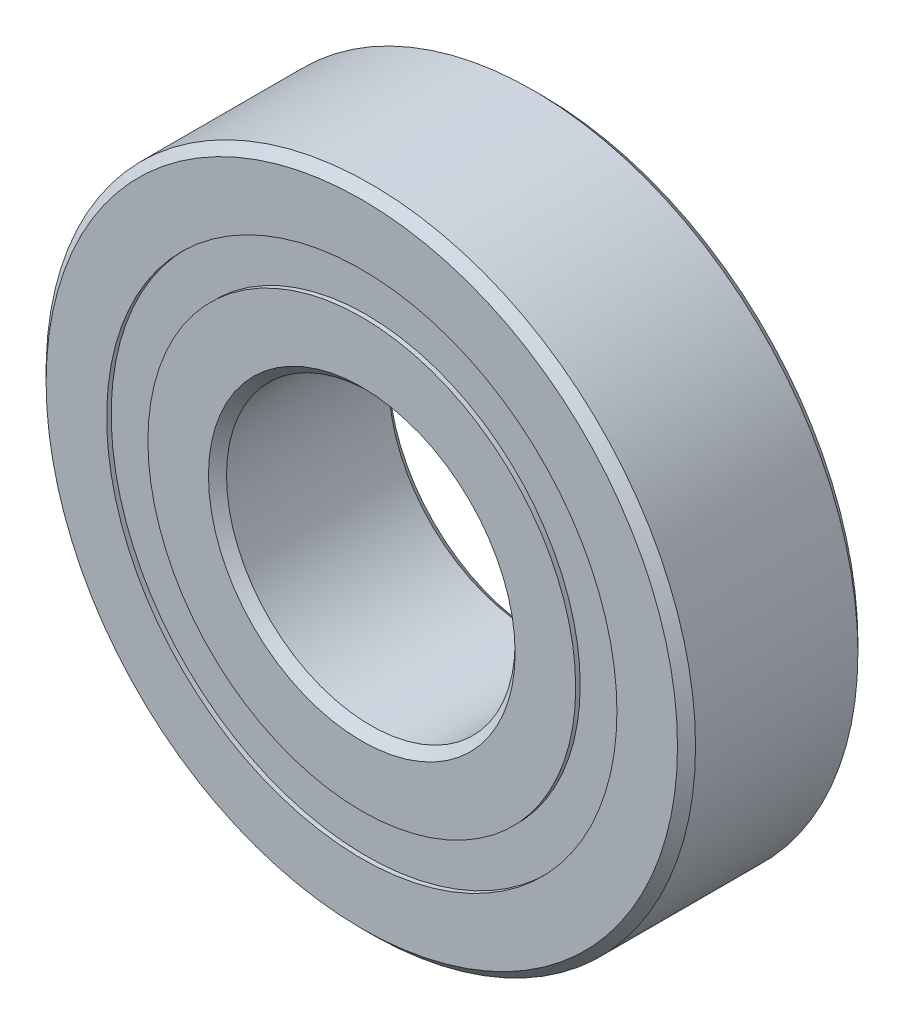
ISO-10303-21;
HEADER;
FILE_DESCRIPTION(('STEP AP214'),'2;1');
FILE_NAME('part.step','',(''),(''),'','','');
FILE_SCHEMA(('AUTOMOTIVE_DESIGN { 1 0 10303 214 1 1 1 1 }'));
ENDSEC;
DATA;
#1=APPLICATION_CONTEXT('core data for automotive mechanical design processes');
#2=APPLICATION_PROTOCOL_DEFINITION('international standard','automotive_design',2000,#1);
#3=PRODUCT_CONTEXT('',#1,'mechanical');
#4=PRODUCT('Part','Part','',(#3));
#5=PRODUCT_RELATED_PRODUCT_CATEGORY('part','',(#4));
#6=PRODUCT_DEFINITION_FORMATION('','',#4);
#7=PRODUCT_DEFINITION_CONTEXT('part definition',#1,'design');
#8=PRODUCT_DEFINITION('design','',#6,#7);
#9=PRODUCT_DEFINITION_SHAPE('','',#8);
#10=(LENGTH_UNIT() NAMED_UNIT(*) SI_UNIT(.MILLI.,.METRE.));
#11=(NAMED_UNIT(*) PLANE_ANGLE_UNIT() SI_UNIT($,.RADIAN.));
#12=(NAMED_UNIT(*) SI_UNIT($,.STERADIAN.) SOLID_ANGLE_UNIT());
#13=UNCERTAINTY_MEASURE_WITH_UNIT(LENGTH_MEASURE(1.E-05),#10,'distance_accuracy_value','');
#14=(GEOMETRIC_REPRESENTATION_CONTEXT(3) GLOBAL_UNCERTAINTY_ASSIGNED_CONTEXT((#13)) GLOBAL_UNIT_ASSIGNED_CONTEXT((#10,
#11,#12)) REPRESENTATION_CONTEXT('',''));
#15=CARTESIAN_POINT('',(0.,0.,0.));
#16=DIRECTION('',(0.,0.,1.));
#17=DIRECTION('',(1.,0.,0.));
#18=AXIS2_PLACEMENT_3D('',#15,#16,#17);
#19=CARTESIAN_POINT('',(0.,11.2258928571429,-3.7703125));
#20=DIRECTION('',(0.,0.,1.));
#21=DIRECTION('',(1.,0.,0.));
#22=AXIS2_PLACEMENT_3D('',#19,#20,#21);
#23=PLANE('',#22);
#24=CARTESIAN_POINT('',(0.,0.,-3.7703125));
#25=DIRECTION('',(0.,0.,1.));
#26=DIRECTION('',(1.,0.,0.));
#27=AXIS2_PLACEMENT_3D('',#24,#25,#26);
#28=CIRCLE('',#27,11.2258928571429);
#29=CARTESIAN_POINT('',(11.2258928571429,0.,-3.7703125));
#30=VERTEX_POINT('',#29);
#31=EDGE_CURVE('E55',#30,#30,#28,.T.);
#32=ORIENTED_EDGE('',*,*,#31,.F.);
#33=EDGE_LOOP('',(#32));
#34=FACE_BOUND('',#33,.T.);
#35=CARTESIAN_POINT('',(0.,0.,-3.7703125));
#36=DIRECTION('',(0.,0.,1.));
#37=DIRECTION('',(1.,0.,0.));
#38=AXIS2_PLACEMENT_3D('',#35,#36,#37);
#39=CIRCLE('',#38,9.41160714285714);
#40=CARTESIAN_POINT('',(9.41160714285714,0.,-3.7703125));
#41=VERTEX_POINT('',#40);
#42=EDGE_CURVE('E11',#41,#41,#39,.T.);
#43=ORIENTED_EDGE('',*,*,#42,.T.);
#44=EDGE_LOOP('',(#43));
#45=FACE_BOUND('',#44,.T.);
#46=ADVANCED_FACE('F41',(#34,#45),#23,.F.);
#47=CARTESIAN_POINT('',(0.,0.,3.96875));
#48=DIRECTION('',(0.,0.,1.));
#49=DIRECTION('',(1.,0.,0.));
#50=AXIS2_PLACEMENT_3D('',#47,#48,#49);
#51=CYLINDRICAL_SURFACE('',#50,9.41160714285714);
#52=ORIENTED_EDGE('',*,*,#42,.F.);
#53=EDGE_LOOP('',(#52));
#54=FACE_BOUND('',#53,.T.);
#55=CARTESIAN_POINT('',(0.,0.,-1.9834848564108));
#56=DIRECTION('',(0.,0.,1.));
#57=DIRECTION('',(1.,0.,0.));
#58=AXIS2_PLACEMENT_3D('',#55,#56,#57);
#59=CIRCLE('',#58,9.41160714285714);
#60=CARTESIAN_POINT('',(9.41160714285714,0.,-1.9834848564108));
#61=VERTEX_POINT('',#60);
#62=EDGE_CURVE('E47',#61,#61,#59,.T.);
#63=ORIENTED_EDGE('',*,*,#62,.T.);
#64=EDGE_LOOP('',(#63));
#65=FACE_BOUND('',#64,.T.);
#66=ADVANCED_FACE('F64',(#54,#65),#51,.F.);
#67=CARTESIAN_POINT('',(0.,11.2258928571429,-1.9834848564108));
#68=DIRECTION('',(0.,0.,-1.));
#69=DIRECTION('',(-1.,0.,0.));
#70=AXIS2_PLACEMENT_3D('',#67,#68,#69);
#71=PLANE('',#70);
#72=ORIENTED_EDGE('',*,*,#62,.F.);
#73=EDGE_LOOP('',(#72));
#74=FACE_BOUND('',#73,.T.);
#75=CARTESIAN_POINT('',(0.,0.,-1.9834848564108));
#76=DIRECTION('',(0.,0.,1.));
#77=DIRECTION('',(1.,0.,0.));
#78=AXIS2_PLACEMENT_3D('',#75,#76,#77);
#79=CIRCLE('',#78,11.2258928571429);
#80=CARTESIAN_POINT('',(11.2258928571429,0.,-1.9834848564108));
#81=VERTEX_POINT('',#80);
#82=EDGE_CURVE('E51',#81,#81,#79,.T.);
#83=ORIENTED_EDGE('',*,*,#82,.T.);
#84=EDGE_LOOP('',(#83));
#85=FACE_BOUND('',#84,.T.);
#86=ADVANCED_FACE('F68',(#74,#85),#71,.F.);
#87=CARTESIAN_POINT('',(0.,0.,3.96875));
#88=DIRECTION('',(0.,0.,1.));
#89=DIRECTION('',(1.,0.,0.));
#90=AXIS2_PLACEMENT_3D('',#87,#88,#89);
#91=CYLINDRICAL_SURFACE('',#90,11.2258928571429);
#92=ORIENTED_EDGE('',*,*,#82,.F.);
#93=EDGE_LOOP('',(#92));
#94=FACE_BOUND('',#93,.T.);
#95=ORIENTED_EDGE('',*,*,#31,.T.);
#96=EDGE_LOOP('',(#95));
#97=FACE_BOUND('',#96,.T.);
#98=ADVANCED_FACE('F61',(#94,#97),#91,.T.);
#99=CLOSED_SHELL('',(#46,#66,#86,#98));
#100=MANIFOLD_SOLID_BREP('B2',#99);
#101=CARTESIAN_POINT('',(0.,11.2258928571429,3.7703125));
#102=DIRECTION('',(0.,0.,-1.));
#103=DIRECTION('',(-1.,0.,0.));
#104=AXIS2_PLACEMENT_3D('',#101,#102,#103);
#105=PLANE('',#104);
#106=CARTESIAN_POINT('',(0.,0.,3.7703125));
#107=DIRECTION('',(0.,0.,1.));
#108=DIRECTION('',(1.,0.,0.));
#109=AXIS2_PLACEMENT_3D('',#106,#107,#108);
#110=CIRCLE('',#109,9.41160714285714);
#111=CARTESIAN_POINT('',(9.41160714285714,0.,3.7703125));
#112=VERTEX_POINT('',#111);
#113=EDGE_CURVE('E40',#112,#112,#110,.T.);
#114=ORIENTED_EDGE('',*,*,#113,.F.);
#115=EDGE_LOOP('',(#114));
#116=FACE_BOUND('',#115,.T.);
#117=CARTESIAN_POINT('',(0.,0.,3.7703125));
#118=DIRECTION('',(0.,0.,1.));
#119=DIRECTION('',(1.,0.,0.));
#120=AXIS2_PLACEMENT_3D('',#117,#118,#119);
#121=CIRCLE('',#120,11.2258928571429);
#122=CARTESIAN_POINT('',(11.2258928571429,0.,3.7703125));
#123=VERTEX_POINT('',#122);
#124=EDGE_CURVE('E122',#123,#123,#121,.T.);
#125=ORIENTED_EDGE('',*,*,#124,.T.);
#126=EDGE_LOOP('',(#125));
#127=FACE_BOUND('',#126,.T.);
#128=ADVANCED_FACE('F108',(#116,#127),#105,.F.);
#129=CARTESIAN_POINT('',(0.,0.,3.96875));
#130=DIRECTION('',(0.,0.,1.));
#131=DIRECTION('',(1.,0.,0.));
#132=AXIS2_PLACEMENT_3D('',#129,#130,#131);
#133=CYLINDRICAL_SURFACE('',#132,9.41160714285714);
#134=CARTESIAN_POINT('',(0.,0.,1.9834848564108));
#135=DIRECTION('',(0.,0.,1.));
#136=DIRECTION('',(1.,0.,0.));
#137=AXIS2_PLACEMENT_3D('',#134,#135,#136);
#138=CIRCLE('',#137,9.41160714285714);
#139=CARTESIAN_POINT('',(9.41160714285714,0.,1.9834848564108));
#140=VERTEX_POINT('',#139);
#141=EDGE_CURVE('E114',#140,#140,#138,.T.);
#142=ORIENTED_EDGE('',*,*,#141,.F.);
#143=EDGE_LOOP('',(#142));
#144=FACE_BOUND('',#143,.T.);
#145=ORIENTED_EDGE('',*,*,#113,.T.);
#146=EDGE_LOOP('',(#145));
#147=FACE_BOUND('',#146,.T.);
#148=ADVANCED_FACE('F137',(#144,#147),#133,.F.);
#149=CARTESIAN_POINT('',(0.,11.2258928571429,1.9834848564108));
#150=DIRECTION('',(0.,0.,1.));
#151=DIRECTION('',(1.,0.,0.));
#152=AXIS2_PLACEMENT_3D('',#149,#150,#151);
#153=PLANE('',#152);
#154=CARTESIAN_POINT('',(0.,0.,1.9834848564108));
#155=DIRECTION('',(0.,0.,1.));
#156=DIRECTION('',(1.,0.,0.));
#157=AXIS2_PLACEMENT_3D('',#154,#155,#156);
#158=CIRCLE('',#157,11.2258928571429);
#159=CARTESIAN_POINT('',(11.2258928571429,0.,1.9834848564108));
#160=VERTEX_POINT('',#159);
#161=EDGE_CURVE('E118',#160,#160,#158,.T.);
#162=ORIENTED_EDGE('',*,*,#161,.F.);
#163=EDGE_LOOP('',(#162));
#164=FACE_BOUND('',#163,.T.);
#165=ORIENTED_EDGE('',*,*,#141,.T.);
#166=EDGE_LOOP('',(#165));
#167=FACE_BOUND('',#166,.T.);
#168=ADVANCED_FACE('F132',(#164,#167),#153,.F.);
#169=CARTESIAN_POINT('',(0.,0.,3.96875));
#170=DIRECTION('',(0.,0.,1.));
#171=DIRECTION('',(1.,0.,0.));
#172=AXIS2_PLACEMENT_3D('',#169,#170,#171);
#173=CYLINDRICAL_SURFACE('',#172,11.2258928571429);
#174=ORIENTED_EDGE('',*,*,#124,.F.);
#175=EDGE_LOOP('',(#174));
#176=FACE_BOUND('',#175,.T.);
#177=ORIENTED_EDGE('',*,*,#161,.T.);
#178=EDGE_LOOP('',(#177));
#179=FACE_BOUND('',#178,.T.);
#180=ADVANCED_FACE('F129',(#176,#179),#173,.T.);
#181=CLOSED_SHELL('',(#128,#148,#168,#180));
#182=MANIFOLD_SOLID_BREP('B6',#181);
#183=CARTESIAN_POINT('',(-6.06520907209285,8.34804411070657,0.));
#184=DIRECTION('',(0.,0.,1.));
#185=DIRECTION('',(-0.587785252292462,0.809016994374955,0.));
#186=AXIS2_PLACEMENT_3D('',#183,#184,#185);
#187=SPHERICAL_SURFACE('',#186,1.9834848564108);
#188=CARTESIAN_POINT('',(-6.06520907209285,8.34804411070657,1.9834848564108));
#189=VERTEX_POINT('',#188);
#190=VERTEX_LOOP('',#189);
#191=FACE_BOUND('',#190,.T.);
#192=ADVANCED_FACE('F175',(#191),#187,.T.);
#193=CLOSED_SHELL('',(#192));
#194=MANIFOLD_SOLID_BREP('B35',#193);
#195=CARTESIAN_POINT('',(-9.81371442752058,3.1886691107066,0.));
#196=DIRECTION('',(0.,0.,1.));
#197=DIRECTION('',(-0.95105651629515,0.309016994374958,0.));
#198=AXIS2_PLACEMENT_3D('',#195,#196,#197);
#199=SPHERICAL_SURFACE('',#198,1.9834848564108);
#200=CARTESIAN_POINT('',(-9.81371442752058,3.1886691107066,1.9834848564108));
#201=VERTEX_POINT('',#200);
#202=VERTEX_LOOP('',#201);
#203=FACE_BOUND('',#202,.T.);
#204=ADVANCED_FACE('F195',(#203),#199,.T.);
#205=CLOSED_SHELL('',(#204));
#206=MANIFOLD_SOLID_BREP('B104',#205);
#207=CARTESIAN_POINT('',(-9.81371442752065,-3.18866911070639,0.));
#208=DIRECTION('',(0.,0.,1.));
#209=DIRECTION('',(-0.951056516295157,-0.309016994374938,0.));
#210=AXIS2_PLACEMENT_3D('',#207,#208,#209);
#211=SPHERICAL_SURFACE('',#210,1.9834848564108);
#212=CARTESIAN_POINT('',(-9.81371442752065,-3.18866911070639,1.9834848564108));
#213=VERTEX_POINT('',#212);
#214=VERTEX_LOOP('',#213);
#215=FACE_BOUND('',#214,.T.);
#216=ADVANCED_FACE('F215',(#215),#211,.T.);
#217=CLOSED_SHELL('',(#216));
#218=MANIFOLD_SOLID_BREP('B171',#217);
#219=CARTESIAN_POINT('',(-6.06520907209303,-8.34804411070643,0.));
#220=DIRECTION('',(0.,0.,1.));
#221=DIRECTION('',(-0.58778525229248,-0.809016994374942,0.));
#222=AXIS2_PLACEMENT_3D('',#219,#220,#221);
#223=SPHERICAL_SURFACE('',#222,1.9834848564108);
#224=CARTESIAN_POINT('',(-6.06520907209303,-8.34804411070643,1.9834848564108));
#225=VERTEX_POINT('',#224);
#226=VERTEX_LOOP('',#225);
#227=FACE_BOUND('',#226,.T.);
#228=ADVANCED_FACE('F235',(#227),#223,.T.);
#229=CLOSED_SHELL('',(#228));
#230=MANIFOLD_SOLID_BREP('B191',#229);
#231=CARTESIAN_POINT('',(0.,-10.31875,0.));
#232=DIRECTION('',(0.,0.,1.));
#233=DIRECTION('',(0.,-1.,0.));
#234=AXIS2_PLACEMENT_3D('',#231,#232,#233);
#235=SPHERICAL_SURFACE('',#234,1.9834848564108);
#236=CARTESIAN_POINT('',(0.,-10.31875,1.9834848564108));
#237=VERTEX_POINT('',#236);
#238=VERTEX_LOOP('',#237);
#239=FACE_BOUND('',#238,.T.);
#240=ADVANCED_FACE('F255',(#239),#235,.T.);
#241=CLOSED_SHELL('',(#240));
#242=MANIFOLD_SOLID_BREP('B211',#241);
#243=CARTESIAN_POINT('',(6.06520907209291,-8.34804411070652,0.));
#244=DIRECTION('',(0.,0.,1.));
#245=DIRECTION('',(0.587785252292469,-0.809016994374951,0.));
#246=AXIS2_PLACEMENT_3D('',#243,#244,#245);
#247=SPHERICAL_SURFACE('',#246,1.9834848564108);
#248=CARTESIAN_POINT('',(6.06520907209291,-8.34804411070652,1.9834848564108));
#249=VERTEX_POINT('',#248);
#250=VERTEX_LOOP('',#249);
#251=FACE_BOUND('',#250,.T.);
#252=ADVANCED_FACE('F275',(#251),#247,.T.);
#253=CLOSED_SHELL('',(#252));
#254=MANIFOLD_SOLID_BREP('B231',#253);
#255=CARTESIAN_POINT('',(9.8137144275206,-3.18866911070653,0.));
#256=DIRECTION('',(0.,0.,1.));
#257=DIRECTION('',(0.951056516295152,-0.309016994374952,0.));
#258=AXIS2_PLACEMENT_3D('',#255,#256,#257);
#259=SPHERICAL_SURFACE('',#258,1.9834848564108);
#260=CARTESIAN_POINT('',(9.8137144275206,-3.18866911070653,1.9834848564108));
#261=VERTEX_POINT('',#260);
#262=VERTEX_LOOP('',#261);
#263=FACE_BOUND('',#262,.T.);
#264=ADVANCED_FACE('F295',(#263),#259,.T.);
#265=CLOSED_SHELL('',(#264));
#266=MANIFOLD_SOLID_BREP('B251',#265);
#267=CARTESIAN_POINT('',(9.81371442752063,3.18866911070646,0.));
#268=DIRECTION('',(0.,0.,1.));
#269=DIRECTION('',(0.951056516295155,0.309016994374945,0.));
#270=AXIS2_PLACEMENT_3D('',#267,#268,#269);
#271=SPHERICAL_SURFACE('',#270,1.9834848564108);
#272=CARTESIAN_POINT('',(9.81371442752063,3.18866911070646,1.9834848564108));
#273=VERTEX_POINT('',#272);
#274=VERTEX_LOOP('',#273);
#275=FACE_BOUND('',#274,.T.);
#276=ADVANCED_FACE('F315',(#275),#271,.T.);
#277=CLOSED_SHELL('',(#276));
#278=MANIFOLD_SOLID_BREP('B271',#277);
#279=CARTESIAN_POINT('',(6.06520907209297,8.34804411070648,0.));
#280=DIRECTION('',(0.,0.,1.));
#281=DIRECTION('',(0.587785252292474,0.809016994374947,0.));
#282=AXIS2_PLACEMENT_3D('',#279,#280,#281);
#283=SPHERICAL_SURFACE('',#282,1.9834848564108);
#284=CARTESIAN_POINT('',(6.06520907209297,8.34804411070648,1.9834848564108));
#285=VERTEX_POINT('',#284);
#286=VERTEX_LOOP('',#285);
#287=FACE_BOUND('',#286,.T.);
#288=ADVANCED_FACE('F335',(#287),#283,.T.);
#289=CLOSED_SHELL('',(#288));
#290=MANIFOLD_SOLID_BREP('B291',#289);
#291=CARTESIAN_POINT('',(0.,10.31875,0.));
#292=DIRECTION('',(0.,0.,1.));
#293=DIRECTION('',(0.,1.,0.));
#294=AXIS2_PLACEMENT_3D('',#291,#292,#293);
#295=SPHERICAL_SURFACE('',#294,1.9834848564108);
#296=CARTESIAN_POINT('',(0.,10.31875,1.9834848564108));
#297=VERTEX_POINT('',#296);
#298=VERTEX_LOOP('',#297);
#299=FACE_BOUND('',#298,.T.);
#300=ADVANCED_FACE('F357',(#299),#295,.T.);
#301=CLOSED_SHELL('',(#300));
#302=MANIFOLD_SOLID_BREP('B311',#301);
#303=CARTESIAN_POINT('',(0.,9.41160714285714,3.96875));
#304=DIRECTION('',(0.,0.,-1.));
#305=DIRECTION('',(-1.,0.,0.));
#306=AXIS2_PLACEMENT_3D('',#303,#304,#305);
#307=PLANE('',#306);
#308=CARTESIAN_POINT('',(0.,0.,3.96875));
#309=DIRECTION('',(0.,0.,1.));
#310=DIRECTION('',(1.,0.,0.));
#311=AXIS2_PLACEMENT_3D('',#308,#309,#310);
#312=CIRCLE('',#311,6.746875);
#313=CARTESIAN_POINT('',(6.746875,0.,3.96875));
#314=VERTEX_POINT('',#313);
#315=EDGE_CURVE('E404',#314,#314,#312,.T.);
#316=ORIENTED_EDGE('',*,*,#315,.F.);
#317=EDGE_LOOP('',(#316));
#318=FACE_BOUND('',#317,.T.);
#319=CARTESIAN_POINT('',(0.,0.,3.96875));
#320=DIRECTION('',(0.,0.,1.));
#321=DIRECTION('',(1.,0.,0.));
#322=AXIS2_PLACEMENT_3D('',#319,#320,#321);
#323=CIRCLE('',#322,9.41160714285714);
#324=CARTESIAN_POINT('',(9.41160714285714,0.,3.96875));
#325=VERTEX_POINT('',#324);
#326=EDGE_CURVE('E356',#325,#325,#323,.T.);
#327=ORIENTED_EDGE('',*,*,#326,.T.);
#328=EDGE_LOOP('',(#327));
#329=FACE_BOUND('',#328,.T.);
#330=ADVANCED_FACE('F376',(#318,#329),#307,.F.);
#331=CARTESIAN_POINT('',(0.,0.,3.96875));
#332=DIRECTION('',(0.,0.,1.));
#333=DIRECTION('',(1.,0.,0.));
#334=AXIS2_PLACEMENT_3D('',#331,#332,#333);
#335=CYLINDRICAL_SURFACE('',#334,9.41160714285714);
#336=ORIENTED_EDGE('',*,*,#326,.F.);
#337=EDGE_LOOP('',(#336));
#338=FACE_BOUND('',#337,.T.);
#339=CARTESIAN_POINT('',(0.,0.,1.76388888888889));
#340=DIRECTION('',(0.,0.,1.));
#341=DIRECTION('',(1.,0.,0.));
#342=AXIS2_PLACEMENT_3D('',#339,#340,#341);
#343=CIRCLE('',#342,9.41160714285714);
#344=CARTESIAN_POINT('',(9.41160714285714,0.,1.76388888888889));
#345=VERTEX_POINT('',#344);
#346=EDGE_CURVE('E382',#345,#345,#343,.T.);
#347=ORIENTED_EDGE('',*,*,#346,.T.);
#348=EDGE_LOOP('',(#347));
#349=FACE_BOUND('',#348,.T.);
#350=ADVANCED_FACE('F411',(#338,#349),#335,.T.);
#351=CARTESIAN_POINT('',(0.,0.,0.));
#352=DIRECTION('',(0.,0.,1.));
#353=DIRECTION('',(1.,0.,0.));
#354=AXIS2_PLACEMENT_3D('',#351,#352,#353);
#355=TOROIDAL_SURFACE('',#354,10.31875,1.9834848564108);
#356=ORIENTED_EDGE('',*,*,#346,.F.);
#357=EDGE_LOOP('',(#356));
#358=FACE_BOUND('',#357,.T.);
#359=CARTESIAN_POINT('',(0.,0.,-1.76388888888889));
#360=DIRECTION('',(0.,0.,1.));
#361=DIRECTION('',(1.,0.,0.));
#362=AXIS2_PLACEMENT_3D('',#359,#360,#361);
#363=CIRCLE('',#362,9.41160714285714);
#364=CARTESIAN_POINT('',(9.41160714285714,0.,-1.76388888888889));
#365=VERTEX_POINT('',#364);
#366=EDGE_CURVE('E386',#365,#365,#363,.T.);
#367=ORIENTED_EDGE('',*,*,#366,.T.);
#368=EDGE_LOOP('',(#367));
#369=FACE_BOUND('',#368,.T.);
#370=ADVANCED_FACE('F415',(#358,#369),#355,.F.);
#371=CARTESIAN_POINT('',(0.,0.,3.96875));
#372=DIRECTION('',(0.,0.,1.));
#373=DIRECTION('',(1.,0.,0.));
#374=AXIS2_PLACEMENT_3D('',#371,#372,#373);
#375=CYLINDRICAL_SURFACE('',#374,9.41160714285714);
#376=ORIENTED_EDGE('',*,*,#366,.F.);
#377=EDGE_LOOP('',(#376));
#378=FACE_BOUND('',#377,.T.);
#379=CARTESIAN_POINT('',(0.,0.,-3.96875));
#380=DIRECTION('',(0.,0.,1.));
#381=DIRECTION('',(1.,0.,0.));
#382=AXIS2_PLACEMENT_3D('',#379,#380,#381);
#383=CIRCLE('',#382,9.41160714285714);
#384=CARTESIAN_POINT('',(9.41160714285714,0.,-3.96875));
#385=VERTEX_POINT('',#384);
#386=EDGE_CURVE('E390',#385,#385,#383,.T.);
#387=ORIENTED_EDGE('',*,*,#386,.T.);
#388=EDGE_LOOP('',(#387));
#389=FACE_BOUND('',#388,.T.);
#390=ADVANCED_FACE('F420',(#378,#389),#375,.T.);
#391=CARTESIAN_POINT('',(0.,6.746875,-3.96875));
#392=DIRECTION('',(0.,0.,1.));
#393=DIRECTION('',(1.,0.,0.));
#394=AXIS2_PLACEMENT_3D('',#391,#392,#393);
#395=PLANE('',#394);
#396=ORIENTED_EDGE('',*,*,#386,.F.);
#397=EDGE_LOOP('',(#396));
#398=FACE_BOUND('',#397,.T.);
#399=CARTESIAN_POINT('',(0.,0.,-3.96875));
#400=DIRECTION('',(0.,0.,1.));
#401=DIRECTION('',(1.,0.,0.));
#402=AXIS2_PLACEMENT_3D('',#399,#400,#401);
#403=CIRCLE('',#402,6.746875);
#404=CARTESIAN_POINT('',(6.746875,0.,-3.96875));
#405=VERTEX_POINT('',#404);
#406=EDGE_CURVE('E395',#405,#405,#403,.T.);
#407=ORIENTED_EDGE('',*,*,#406,.T.);
#408=EDGE_LOOP('',(#407));
#409=FACE_BOUND('',#408,.T.);
#410=ADVANCED_FACE('F426',(#398,#409),#395,.F.);
#411=CARTESIAN_POINT('',(0.,0.,-3.571875));
#412=DIRECTION('',(0.,0.,-1.));
#413=DIRECTION('',(-1.,0.,0.));
#414=AXIS2_PLACEMENT_3D('',#411,#412,#413);
#415=CONICAL_SURFACE('',#414,6.35,0.785398163397448);
#416=ORIENTED_EDGE('',*,*,#406,.F.);
#417=EDGE_LOOP('',(#416));
#418=FACE_BOUND('',#417,.T.);
#419=CARTESIAN_POINT('',(0.,0.,-3.571875));
#420=DIRECTION('',(0.,0.,1.));
#421=DIRECTION('',(1.,0.,0.));
#422=AXIS2_PLACEMENT_3D('',#419,#420,#421);
#423=CIRCLE('',#422,6.35);
#424=CARTESIAN_POINT('',(6.35,0.,-3.571875));
#425=VERTEX_POINT('',#424);
#426=EDGE_CURVE('E398',#425,#425,#423,.T.);
#427=ORIENTED_EDGE('',*,*,#426,.T.);
#428=EDGE_LOOP('',(#427));
#429=FACE_BOUND('',#428,.T.);
#430=ADVANCED_FACE('F430',(#418,#429),#415,.F.);
#431=CARTESIAN_POINT('',(0.,0.,3.96875));
#432=DIRECTION('',(0.,0.,1.));
#433=DIRECTION('',(1.,0.,0.));
#434=AXIS2_PLACEMENT_3D('',#431,#432,#433);
#435=CYLINDRICAL_SURFACE('',#434,6.35);
#436=ORIENTED_EDGE('',*,*,#426,.F.);
#437=EDGE_LOOP('',(#436));
#438=FACE_BOUND('',#437,.T.);
#439=CARTESIAN_POINT('',(0.,0.,3.571875));
#440=DIRECTION('',(0.,0.,1.));
#441=DIRECTION('',(1.,0.,0.));
#442=AXIS2_PLACEMENT_3D('',#439,#440,#441);
#443=CIRCLE('',#442,6.35);
#444=CARTESIAN_POINT('',(6.35,0.,3.571875));
#445=VERTEX_POINT('',#444);
#446=EDGE_CURVE('E401',#445,#445,#443,.T.);
#447=ORIENTED_EDGE('',*,*,#446,.T.);
#448=EDGE_LOOP('',(#447));
#449=FACE_BOUND('',#448,.T.);
#450=ADVANCED_FACE('F434',(#438,#449),#435,.F.);
#451=CARTESIAN_POINT('',(0.,0.,3.96875));
#452=DIRECTION('',(0.,0.,1.));
#453=DIRECTION('',(1.,0.,0.));
#454=AXIS2_PLACEMENT_3D('',#451,#452,#453);
#455=CONICAL_SURFACE('',#454,6.746875,0.785398163397447);
#456=ORIENTED_EDGE('',*,*,#446,.F.);
#457=EDGE_LOOP('',(#456));
#458=FACE_BOUND('',#457,.T.);
#459=ORIENTED_EDGE('',*,*,#315,.T.);
#460=EDGE_LOOP('',(#459));
#461=FACE_BOUND('',#460,.T.);
#462=ADVANCED_FACE('F408',(#458,#461),#455,.F.);
#463=CLOSED_SHELL('',(#330,#350,#370,#390,#410,#430,#450,#462));
#464=MANIFOLD_SOLID_BREP('B331',#463);
#465=CARTESIAN_POINT('',(0.,0.,3.571875));
#466=DIRECTION('',(0.,0.,-1.));
#467=DIRECTION('',(-1.,0.,0.));
#468=AXIS2_PLACEMENT_3D('',#465,#466,#467);
#469=CONICAL_SURFACE('',#468,14.2875,0.785398163397448);
#470=CARTESIAN_POINT('',(0.,0.,3.96875));
#471=DIRECTION('',(0.,0.,1.));
#472=DIRECTION('',(1.,0.,0.));
#473=AXIS2_PLACEMENT_3D('',#470,#471,#472);
#474=CIRCLE('',#473,13.890625);
#475=CARTESIAN_POINT('',(13.890625,0.,3.96875));
#476=VERTEX_POINT('',#475);
#477=EDGE_CURVE('E525',#476,#476,#474,.T.);
#478=ORIENTED_EDGE('',*,*,#477,.F.);
#479=EDGE_LOOP('',(#478));
#480=FACE_BOUND('',#479,.T.);
#481=CARTESIAN_POINT('',(0.,0.,3.571875));
#482=DIRECTION('',(0.,0.,1.));
#483=DIRECTION('',(1.,0.,0.));
#484=AXIS2_PLACEMENT_3D('',#481,#482,#483);
#485=CIRCLE('',#484,14.2875);
#486=CARTESIAN_POINT('',(14.2875,0.,3.571875));
#487=VERTEX_POINT('',#486);
#488=EDGE_CURVE('E375',#487,#487,#485,.T.);
#489=ORIENTED_EDGE('',*,*,#488,.T.);
#490=EDGE_LOOP('',(#489));
#491=FACE_BOUND('',#490,.T.);
#492=ADVANCED_FACE('F497',(#480,#491),#469,.T.);
#493=CARTESIAN_POINT('',(0.,0.,3.96875));
#494=DIRECTION('',(0.,0.,1.));
#495=DIRECTION('',(1.,0.,0.));
#496=AXIS2_PLACEMENT_3D('',#493,#494,#495);
#497=CYLINDRICAL_SURFACE('',#496,14.2875);
#498=ORIENTED_EDGE('',*,*,#488,.F.);
#499=EDGE_LOOP('',(#498));
#500=FACE_BOUND('',#499,.T.);
#501=CARTESIAN_POINT('',(0.,0.,-3.571875));
#502=DIRECTION('',(0.,0.,1.));
#503=DIRECTION('',(1.,0.,0.));
#504=AXIS2_PLACEMENT_3D('',#501,#502,#503);
#505=CIRCLE('',#504,14.2875);
#506=CARTESIAN_POINT('',(14.2875,0.,-3.571875));
#507=VERTEX_POINT('',#506);
#508=EDGE_CURVE('E503',#507,#507,#505,.T.);
#509=ORIENTED_EDGE('',*,*,#508,.T.);
#510=EDGE_LOOP('',(#509));
#511=FACE_BOUND('',#510,.T.);
#512=ADVANCED_FACE('F532',(#500,#511),#497,.T.);
#513=CARTESIAN_POINT('',(0.,0.,-3.96875));
#514=DIRECTION('',(0.,0.,1.));
#515=DIRECTION('',(1.,0.,0.));
#516=AXIS2_PLACEMENT_3D('',#513,#514,#515);
#517=CONICAL_SURFACE('',#516,13.890625,0.785398163397448);
#518=ORIENTED_EDGE('',*,*,#508,.F.);
#519=EDGE_LOOP('',(#518));
#520=FACE_BOUND('',#519,.T.);
#521=CARTESIAN_POINT('',(0.,0.,-3.96875));
#522=DIRECTION('',(0.,0.,1.));
#523=DIRECTION('',(1.,0.,0.));
#524=AXIS2_PLACEMENT_3D('',#521,#522,#523);
#525=CIRCLE('',#524,13.890625);
#526=CARTESIAN_POINT('',(13.890625,0.,-3.96875));
#527=VERTEX_POINT('',#526);
#528=EDGE_CURVE('E507',#527,#527,#525,.T.);
#529=ORIENTED_EDGE('',*,*,#528,.T.);
#530=EDGE_LOOP('',(#529));
#531=FACE_BOUND('',#530,.T.);
#532=ADVANCED_FACE('F536',(#520,#531),#517,.T.);
#533=CARTESIAN_POINT('',(0.,13.890625,-3.96875));
#534=DIRECTION('',(0.,0.,1.));
#535=DIRECTION('',(1.,0.,0.));
#536=AXIS2_PLACEMENT_3D('',#533,#534,#535);
#537=PLANE('',#536);
#538=ORIENTED_EDGE('',*,*,#528,.F.);
#539=EDGE_LOOP('',(#538));
#540=FACE_BOUND('',#539,.T.);
#541=CARTESIAN_POINT('',(0.,0.,-3.96875));
#542=DIRECTION('',(0.,0.,1.));
#543=DIRECTION('',(1.,0.,0.));
#544=AXIS2_PLACEMENT_3D('',#541,#542,#543);
#545=CIRCLE('',#544,11.2258928571429);
#546=CARTESIAN_POINT('',(11.2258928571429,0.,-3.96875));
#547=VERTEX_POINT('',#546);
#548=EDGE_CURVE('E511',#547,#547,#545,.T.);
#549=ORIENTED_EDGE('',*,*,#548,.T.);
#550=EDGE_LOOP('',(#549));
#551=FACE_BOUND('',#550,.T.);
#552=ADVANCED_FACE('F541',(#540,#551),#537,.F.);
#553=CARTESIAN_POINT('',(0.,0.,3.96875));
#554=DIRECTION('',(0.,0.,1.));
#555=DIRECTION('',(1.,0.,0.));
#556=AXIS2_PLACEMENT_3D('',#553,#554,#555);
#557=CYLINDRICAL_SURFACE('',#556,11.2258928571429);
#558=ORIENTED_EDGE('',*,*,#548,.F.);
#559=EDGE_LOOP('',(#558));
#560=FACE_BOUND('',#559,.T.);
#561=CARTESIAN_POINT('',(0.,0.,-1.76388888888889));
#562=DIRECTION('',(0.,0.,1.));
#563=DIRECTION('',(1.,0.,0.));
#564=AXIS2_PLACEMENT_3D('',#561,#562,#563);
#565=CIRCLE('',#564,11.2258928571429);
#566=CARTESIAN_POINT('',(11.2258928571429,0.,-1.76388888888889));
#567=VERTEX_POINT('',#566);
#568=EDGE_CURVE('E516',#567,#567,#565,.T.);
#569=ORIENTED_EDGE('',*,*,#568,.T.);
#570=EDGE_LOOP('',(#569));
#571=FACE_BOUND('',#570,.T.);
#572=ADVANCED_FACE('F547',(#560,#571),#557,.F.);
#573=CARTESIAN_POINT('',(0.,0.,0.));
#574=DIRECTION('',(0.,0.,1.));
#575=DIRECTION('',(1.,0.,0.));
#576=AXIS2_PLACEMENT_3D('',#573,#574,#575);
#577=TOROIDAL_SURFACE('',#576,10.31875,1.9834848564108);
#578=ORIENTED_EDGE('',*,*,#568,.F.);
#579=EDGE_LOOP('',(#578));
#580=FACE_BOUND('',#579,.T.);
#581=CARTESIAN_POINT('',(0.,0.,1.76388888888889));
#582=DIRECTION('',(0.,0.,1.));
#583=DIRECTION('',(1.,0.,0.));
#584=AXIS2_PLACEMENT_3D('',#581,#582,#583);
#585=CIRCLE('',#584,11.2258928571429);
#586=CARTESIAN_POINT('',(11.2258928571429,0.,1.76388888888889));
#587=VERTEX_POINT('',#586);
#588=EDGE_CURVE('E519',#587,#587,#585,.T.);
#589=ORIENTED_EDGE('',*,*,#588,.T.);
#590=EDGE_LOOP('',(#589));
#591=FACE_BOUND('',#590,.T.);
#592=ADVANCED_FACE('F551',(#580,#591),#577,.F.);
#593=CARTESIAN_POINT('',(0.,0.,3.96875));
#594=DIRECTION('',(0.,0.,1.));
#595=DIRECTION('',(1.,0.,0.));
#596=AXIS2_PLACEMENT_3D('',#593,#594,#595);
#597=CYLINDRICAL_SURFACE('',#596,11.2258928571429);
#598=ORIENTED_EDGE('',*,*,#588,.F.);
#599=EDGE_LOOP('',(#598));
#600=FACE_BOUND('',#599,.T.);
#601=CARTESIAN_POINT('',(0.,0.,3.96875));
#602=DIRECTION('',(0.,0.,1.));
#603=DIRECTION('',(1.,0.,0.));
#604=AXIS2_PLACEMENT_3D('',#601,#602,#603);
#605=CIRCLE('',#604,11.2258928571429);
#606=CARTESIAN_POINT('',(11.2258928571429,0.,3.96875));
#607=VERTEX_POINT('',#606);
#608=EDGE_CURVE('E522',#607,#607,#605,.T.);
#609=ORIENTED_EDGE('',*,*,#608,.T.);
#610=EDGE_LOOP('',(#609));
#611=FACE_BOUND('',#610,.T.);
#612=ADVANCED_FACE('F555',(#600,#611),#597,.F.);
#613=CARTESIAN_POINT('',(0.,13.890625,3.96875));
#614=DIRECTION('',(0.,0.,-1.));
#615=DIRECTION('',(-1.,0.,0.));
#616=AXIS2_PLACEMENT_3D('',#613,#614,#615);
#617=PLANE('',#616);
#618=ORIENTED_EDGE('',*,*,#608,.F.);
#619=EDGE_LOOP('',(#618));
#620=FACE_BOUND('',#619,.T.);
#621=ORIENTED_EDGE('',*,*,#477,.T.);
#622=EDGE_LOOP('',(#621));
#623=FACE_BOUND('',#622,.T.);
#624=ADVANCED_FACE('F529',(#620,#623),#617,.F.);
#625=CLOSED_SHELL('',(#492,#512,#532,#552,#572,#592,#612,#624));
#626=MANIFOLD_SOLID_BREP('B351',#625);
#627=ADVANCED_BREP_SHAPE_REPRESENTATION('',(#18,#100,#182,#194,#206,#218,#230,#242,#254,#266,
#278,#290,#302,#464,#626),#14);
#628=SHAPE_DEFINITION_REPRESENTATION(#9,#627);
ENDSEC;
END-ISO-10303-21;
